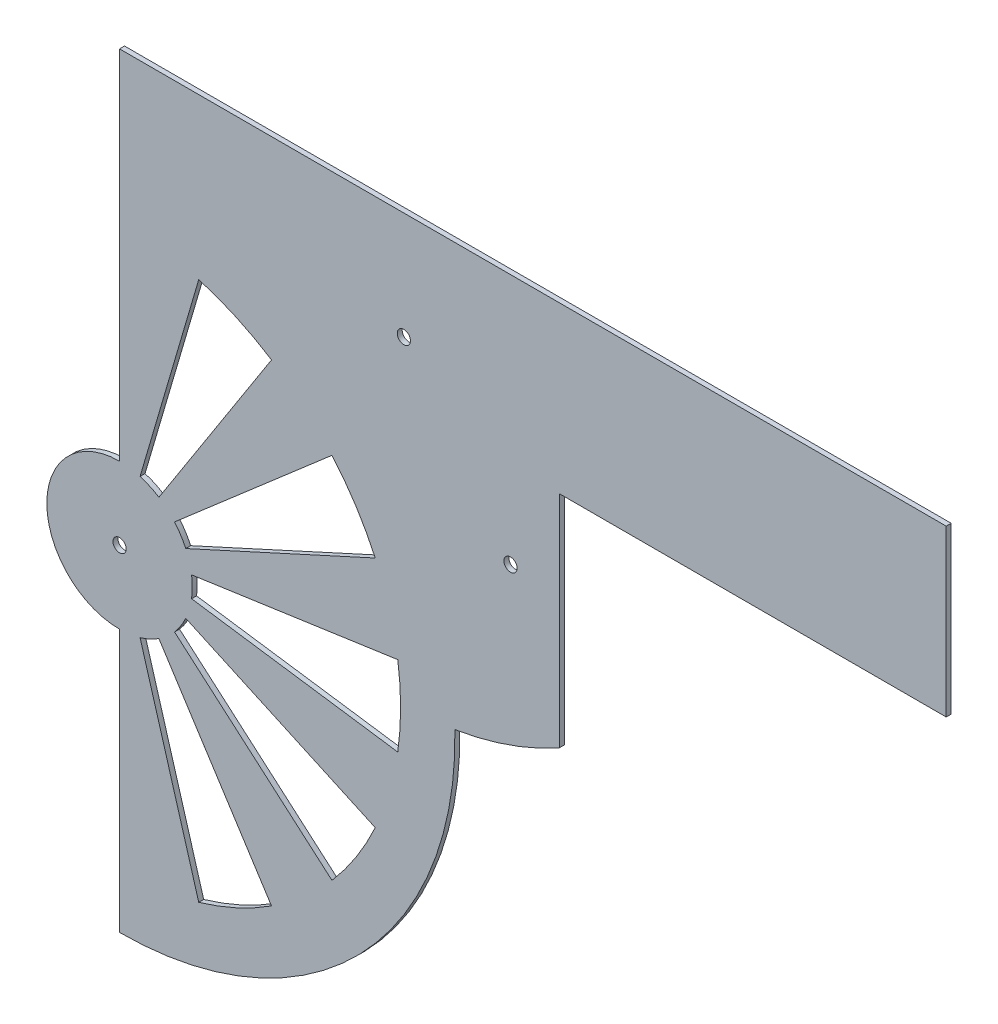
ISO-10303-21;
HEADER;
FILE_DESCRIPTION(('STEP AP214'),'2;1');
FILE_NAME('part.step','',(''),(''),'','','');
FILE_SCHEMA(('AUTOMOTIVE_DESIGN { 1 0 10303 214 1 1 1 1 }'));
ENDSEC;
DATA;
#1=APPLICATION_CONTEXT('core data for automotive mechanical design processes');
#2=APPLICATION_PROTOCOL_DEFINITION('international standard','automotive_design',2000,#1);
#3=PRODUCT_CONTEXT('',#1,'mechanical');
#4=PRODUCT('Part','Part','',(#3));
#5=PRODUCT_RELATED_PRODUCT_CATEGORY('part','',(#4));
#6=PRODUCT_DEFINITION_FORMATION('','',#4);
#7=PRODUCT_DEFINITION_CONTEXT('part definition',#1,'design');
#8=PRODUCT_DEFINITION('design','',#6,#7);
#9=PRODUCT_DEFINITION_SHAPE('','',#8);
#10=(LENGTH_UNIT() NAMED_UNIT(*) SI_UNIT(.MILLI.,.METRE.));
#11=(NAMED_UNIT(*) PLANE_ANGLE_UNIT() SI_UNIT($,.RADIAN.));
#12=(NAMED_UNIT(*) SI_UNIT($,.STERADIAN.) SOLID_ANGLE_UNIT());
#13=UNCERTAINTY_MEASURE_WITH_UNIT(LENGTH_MEASURE(1.E-05),#10,'distance_accuracy_value','');
#14=(GEOMETRIC_REPRESENTATION_CONTEXT(3) GLOBAL_UNCERTAINTY_ASSIGNED_CONTEXT((#13)) GLOBAL_UNIT_ASSIGNED_CONTEXT((#10,
#11,#12)) REPRESENTATION_CONTEXT('',''));
#15=CARTESIAN_POINT('',(0.,0.,0.));
#16=DIRECTION('',(0.,0.,1.));
#17=DIRECTION('',(1.,0.,0.));
#18=AXIS2_PLACEMENT_3D('',#15,#16,#17);
#19=CARTESIAN_POINT('',(85.9770201636294,97.5087278338861,1.5));
#20=DIRECTION('',(0.,0.,1.));
#21=DIRECTION('',(1.,0.,0.));
#22=AXIS2_PLACEMENT_3D('',#19,#20,#21);
#23=PLANE('',#22);
#24=CARTESIAN_POINT('',(0.,0.,1.5));
#25=DIRECTION('',(0.,0.,-1.));
#26=DIRECTION('',(1.,0.,0.));
#27=AXIS2_PLACEMENT_3D('',#24,#25,#26);
#28=CIRCLE('',#27,22.);
#29=CARTESIAN_POINT('',(21.7760717213805,3.13092644201265,1.5));
#30=VERTEX_POINT('',#29);
#31=CARTESIAN_POINT('',(21.7760717213806,-3.13092644201181,1.5));
#32=VERTEX_POINT('',#31);
#33=EDGE_CURVE('E48',#30,#32,#28,.T.);
#34=ORIENTED_EDGE('',*,*,#33,.F.);
#35=DIRECTION('',(-0.98982144188093,-0.142314838273304,0.));
#36=VECTOR('',#35,1.);
#37=CARTESIAN_POINT('',(21.7760717213805,3.13092644201265,1.5));
#38=LINE('',#37,#36);
#39=CARTESIAN_POINT('',(84.1348225598791,12.0967612532308,1.5));
#40=VERTEX_POINT('',#39);
#41=EDGE_CURVE('E242',#40,#30,#38,.T.);
#42=ORIENTED_EDGE('',*,*,#41,.F.);
#43=CARTESIAN_POINT('',(0.,0.,1.5));
#44=DIRECTION('',(0.,0.,1.));
#45=DIRECTION('',(1.,0.,0.));
#46=AXIS2_PLACEMENT_3D('',#43,#44,#45);
#47=CIRCLE('',#46,85.);
#48=CARTESIAN_POINT('',(84.1348225598796,-12.0967612532274,1.5));
#49=VERTEX_POINT('',#48);
#50=EDGE_CURVE('E245',#49,#40,#47,.T.);
#51=ORIENTED_EDGE('',*,*,#50,.F.);
#52=DIRECTION('',(0.989821441880936,-0.142314838273262,0.));
#53=VECTOR('',#52,1.);
#54=CARTESIAN_POINT('',(21.7760717213806,-3.13092644201181,1.5));
#55=LINE('',#54,#53);
#56=EDGE_CURVE('E251',#32,#49,#55,.T.);
#57=ORIENTED_EDGE('',*,*,#56,.F.);
#58=EDGE_LOOP('',(#34,#42,#51,#57));
#59=FACE_BOUND('',#58,.T.);
#60=CARTESIAN_POINT('',(0.,0.,1.5));
#61=DIRECTION('',(0.,0.,1.));
#62=DIRECTION('',(1.,0.,0.));
#63=AXIS2_PLACEMENT_3D('',#60,#61,#62);
#64=CIRCLE('',#63,85.);
#65=CARTESIAN_POINT('',(64.2387138201136,-55.6631623853473,1.5));
#66=VERTEX_POINT('',#65);
#67=CARTESIAN_POINT('',(77.318719605135,-35.3102761051583,1.5));
#68=VERTEX_POINT('',#67);
#69=EDGE_CURVE('E257',#66,#68,#64,.T.);
#70=ORIENTED_EDGE('',*,*,#69,.F.);
#71=DIRECTION('',(0.755749574354278,-0.654860733945262,0.));
#72=VECTOR('',#71,1.);
#73=CARTESIAN_POINT('',(16.6264906357941,-14.4069361467958,1.5));
#74=LINE('',#73,#72);
#75=CARTESIAN_POINT('',(16.6264906357941,-14.4069361467958,1.5));
#76=VERTEX_POINT('',#75);
#77=EDGE_CURVE('E265',#76,#66,#74,.T.);
#78=ORIENTED_EDGE('',*,*,#77,.F.);
#79=CARTESIAN_POINT('',(0.,0.,1.5));
#80=DIRECTION('',(0.,0.,-1.));
#81=DIRECTION('',(1.,0.,0.));
#82=AXIS2_PLACEMENT_3D('',#79,#80,#81);
#83=CIRCLE('',#82,22.);
#84=CARTESIAN_POINT('',(20.0119038977996,-9.139130286041,1.5));
#85=VERTEX_POINT('',#84);
#86=EDGE_CURVE('E279',#85,#76,#83,.T.);
#87=ORIENTED_EDGE('',*,*,#86,.F.);
#88=DIRECTION('',(-0.90963199535453,0.415415013001862,0.));
#89=VECTOR('',#88,1.);
#90=CARTESIAN_POINT('',(20.0119038977996,-9.139130286041,1.5));
#91=LINE('',#90,#89);
#92=EDGE_CURVE('E276',#68,#85,#91,.T.);
#93=ORIENTED_EDGE('',*,*,#92,.F.);
#94=EDGE_LOOP('',(#70,#78,#87,#93));
#95=FACE_BOUND('',#94,.T.);
#96=CARTESIAN_POINT('',(0.,0.,1.5));
#97=DIRECTION('',(0.,0.,-1.));
#98=DIRECTION('',(1.,0.,0.));
#99=AXIS2_PLACEMENT_3D('',#96,#97,#98);
#100=CIRCLE('',#99,22.);
#101=CARTESIAN_POINT('',(16.6264906357935,14.4069361467964,1.5));
#102=VERTEX_POINT('',#101);
#103=CARTESIAN_POINT('',(20.0119038977993,9.13913028604177,1.5));
#104=VERTEX_POINT('',#103);
#105=EDGE_CURVE('E286',#102,#104,#100,.T.);
#106=ORIENTED_EDGE('',*,*,#105,.F.);
#107=DIRECTION('',(-0.755749574354251,-0.654860733945294,0.));
#108=VECTOR('',#107,1.);
#109=CARTESIAN_POINT('',(16.6264906357935,14.4069361467964,1.5));
#110=LINE('',#109,#108);
#111=CARTESIAN_POINT('',(64.2387138201113,55.66316238535,1.5));
#112=VERTEX_POINT('',#111);
#113=EDGE_CURVE('E297',#112,#102,#110,.T.);
#114=ORIENTED_EDGE('',*,*,#113,.F.);
#115=CARTESIAN_POINT('',(0.,0.,1.5));
#116=DIRECTION('',(0.,0.,1.));
#117=DIRECTION('',(1.,0.,0.));
#118=AXIS2_PLACEMENT_3D('',#115,#116,#117);
#119=CIRCLE('',#118,85.);
#120=CARTESIAN_POINT('',(77.3187196051335,35.3102761051615,1.5));
#121=VERTEX_POINT('',#120);
#122=EDGE_CURVE('E311',#121,#112,#119,.T.);
#123=ORIENTED_EDGE('',*,*,#122,.F.);
#124=DIRECTION('',(0.909631995354512,0.415415013001901,0.));
#125=VECTOR('',#124,1.);
#126=CARTESIAN_POINT('',(20.0119038977993,9.13913028604177,1.5));
#127=LINE('',#126,#125);
#128=EDGE_CURVE('E308',#104,#121,#127,.T.);
#129=ORIENTED_EDGE('',*,*,#128,.F.);
#130=EDGE_LOOP('',(#106,#114,#123,#129));
#131=FACE_BOUND('',#130,.T.);
#132=CARTESIAN_POINT('',(0.,0.,1.5));
#133=DIRECTION('',(0.,0.,1.));
#134=DIRECTION('',(1.,0.,0.));
#135=AXIS2_PLACEMENT_3D('',#132,#133,#134);
#136=CIRCLE('',#135,85.);
#137=CARTESIAN_POINT('',(23.9472673315246,-81.5569027572314,1.5));
#138=VERTEX_POINT('',#137);
#139=CARTESIAN_POINT('',(45.9544694837282,-71.5065502906489,1.5));
#140=VERTEX_POINT('',#139);
#141=EDGE_CURVE('E318',#138,#140,#136,.T.);
#142=ORIENTED_EDGE('',*,*,#141,.F.);
#143=DIRECTION('',(0.281732556841467,-0.959492973614486,0.));
#144=VECTOR('',#143,1.);
#145=CARTESIAN_POINT('',(6.19811625051222,-21.1088454195187,1.5));
#146=LINE('',#145,#144);
#147=CARTESIAN_POINT('',(6.19811625051222,-21.1088454195187,1.5));
#148=VERTEX_POINT('',#147);
#149=EDGE_CURVE('E329',#148,#138,#146,.T.);
#150=ORIENTED_EDGE('',*,*,#149,.F.);
#151=CARTESIAN_POINT('',(0.,0.,1.5));
#152=DIRECTION('',(0.,0.,-1.));
#153=DIRECTION('',(1.,0.,0.));
#154=AXIS2_PLACEMENT_3D('',#151,#152,#153);
#155=CIRCLE('',#154,22.);
#156=CARTESIAN_POINT('',(11.8940979840237,-18.5075777222856,1.5));
#157=VERTEX_POINT('',#156);
#158=EDGE_CURVE('E343',#157,#148,#155,.T.);
#159=ORIENTED_EDGE('',*,*,#158,.F.);
#160=DIRECTION('',(-0.540640817455627,0.841253532831163,0.));
#161=VECTOR('',#160,1.);
#162=CARTESIAN_POINT('',(11.8940979840237,-18.5075777222856,1.5));
#163=LINE('',#162,#161);
#164=EDGE_CURVE('E340',#140,#157,#163,.T.);
#165=ORIENTED_EDGE('',*,*,#164,.F.);
#166=EDGE_LOOP('',(#142,#150,#159,#165));
#167=FACE_BOUND('',#166,.T.);
#168=CARTESIAN_POINT('',(0.,0.,1.5));
#169=DIRECTION('',(0.,0.,-1.));
#170=DIRECTION('',(1.,0.,0.));
#171=AXIS2_PLACEMENT_3D('',#168,#169,#170);
#172=CIRCLE('',#171,22.);
#173=CARTESIAN_POINT('',(6.19811625051141,21.108845419519,1.5));
#174=VERTEX_POINT('',#173);
#175=CARTESIAN_POINT('',(11.894097984023,18.5075777222861,1.5));
#176=VERTEX_POINT('',#175);
#177=EDGE_CURVE('E350',#174,#176,#172,.T.);
#178=ORIENTED_EDGE('',*,*,#177,.F.);
#179=DIRECTION('',(-0.281732556841426,-0.959492973614498,0.));
#180=VECTOR('',#179,1.);
#181=CARTESIAN_POINT('',(6.19811625051141,21.108845419519,1.5));
#182=LINE('',#181,#180);
#183=CARTESIAN_POINT('',(23.9472673315213,81.5569027572324,1.5));
#184=VERTEX_POINT('',#183);
#185=EDGE_CURVE('E361',#184,#174,#182,.T.);
#186=ORIENTED_EDGE('',*,*,#185,.F.);
#187=CARTESIAN_POINT('',(0.,0.,1.5));
#188=DIRECTION('',(0.,0.,1.));
#189=DIRECTION('',(1.,0.,0.));
#190=AXIS2_PLACEMENT_3D('',#187,#188,#189);
#191=CIRCLE('',#190,85.);
#192=CARTESIAN_POINT('',(45.9544694837253,71.5065502906507,1.5));
#193=VERTEX_POINT('',#192);
#194=EDGE_CURVE('E375',#193,#184,#191,.T.);
#195=ORIENTED_EDGE('',*,*,#194,.F.);
#196=DIRECTION('',(0.540640817455591,0.841253532831185,0.));
#197=VECTOR('',#196,1.);
#198=CARTESIAN_POINT('',(11.894097984023,18.5075777222861,1.5));
#199=LINE('',#198,#197);
#200=EDGE_CURVE('E372',#176,#193,#199,.T.);
#201=ORIENTED_EDGE('',*,*,#200,.F.);
#202=EDGE_LOOP('',(#178,#186,#195,#201));
#203=FACE_BOUND('',#202,.T.);
#204=CARTESIAN_POINT('',(85.9770201636294,97.5087278338861,1.5));
#205=DIRECTION('',(0.,0.,1.));
#206=DIRECTION('',(1.,0.,0.));
#207=AXIS2_PLACEMENT_3D('',#204,#205,#206);
#208=CIRCLE('',#207,2.);
#209=CARTESIAN_POINT('',(87.9770201636294,97.5087278338861,1.5));
#210=VERTEX_POINT('',#209);
#211=EDGE_CURVE('E395',#210,#210,#208,.T.);
#212=ORIENTED_EDGE('',*,*,#211,.F.);
#213=EDGE_LOOP('',(#212));
#214=FACE_BOUND('',#213,.T.);
#215=DIRECTION('',(-1.,0.,0.));
#216=VECTOR('',#215,1.);
#217=CARTESIAN_POINT('',(0.,130.,1.5));
#218=LINE('',#217,#216);
#219=CARTESIAN_POINT('',(250.,130.,1.5));
#220=VERTEX_POINT('',#219);
#221=CARTESIAN_POINT('',(0.,130.,1.5));
#222=VERTEX_POINT('',#221);
#223=EDGE_CURVE('E407',#220,#222,#218,.T.);
#224=ORIENTED_EDGE('',*,*,#223,.T.);
#225=DIRECTION('',(0.,-1.,0.));
#226=VECTOR('',#225,1.);
#227=CARTESIAN_POINT('',(0.,130.,1.5));
#228=LINE('',#227,#226);
#229=CARTESIAN_POINT('',(0.,22.,1.5));
#230=VERTEX_POINT('',#229);
#231=EDGE_CURVE('E410',#222,#230,#228,.T.);
#232=ORIENTED_EDGE('',*,*,#231,.T.);
#233=CARTESIAN_POINT('',(0.,0.,1.5));
#234=DIRECTION('',(0.,0.,1.));
#235=DIRECTION('',(1.,0.,0.));
#236=AXIS2_PLACEMENT_3D('',#233,#234,#235);
#237=CIRCLE('',#236,22.);
#238=CARTESIAN_POINT('',(0.,-22.,1.5));
#239=VERTEX_POINT('',#238);
#240=EDGE_CURVE('E413',#230,#239,#237,.T.);
#241=ORIENTED_EDGE('',*,*,#240,.T.);
#242=DIRECTION('',(0.,-1.,0.));
#243=VECTOR('',#242,1.);
#244=CARTESIAN_POINT('',(0.,-22.,1.5));
#245=LINE('',#244,#243);
#246=CARTESIAN_POINT('',(0.,-101.42617394616,1.5));
#247=VERTEX_POINT('',#246);
#248=EDGE_CURVE('E415',#239,#247,#245,.T.);
#249=ORIENTED_EDGE('',*,*,#248,.T.);
#250=CARTESIAN_POINT('',(0.,0.,1.5));
#251=DIRECTION('',(0.,0.,1.));
#252=DIRECTION('',(1.,0.,0.));
#253=AXIS2_PLACEMENT_3D('',#250,#251,#252);
#254=CIRCLE('',#253,101.42617394616);
#255=CARTESIAN_POINT('',(101.397454871573,2.41348439478572,1.5));
#256=VERTEX_POINT('',#255);
#257=EDGE_CURVE('E417',#247,#256,#254,.T.);
#258=ORIENTED_EDGE('',*,*,#257,.T.);
#259=CARTESIAN_POINT('',(85.9770201636294,97.5087278338861,1.5));
#260=DIRECTION('',(0.,0.,1.));
#261=DIRECTION('',(1.,0.,0.));
#262=AXIS2_PLACEMENT_3D('',#259,#260,#261);
#263=CIRCLE('',#262,96.3374025564512);
#264=CARTESIAN_POINT('',(132.983960447751,13.4180464449907,1.5));
#265=VERTEX_POINT('',#264);
#266=EDGE_CURVE('E419',#256,#265,#263,.T.);
#267=ORIENTED_EDGE('',*,*,#266,.T.);
#268=DIRECTION('',(0.,1.,0.));
#269=VECTOR('',#268,1.);
#270=CARTESIAN_POINT('',(132.983960447751,80.,1.5));
#271=LINE('',#270,#269);
#272=CARTESIAN_POINT('',(132.983960447751,80.,1.5));
#273=VERTEX_POINT('',#272);
#274=EDGE_CURVE('E421',#265,#273,#271,.T.);
#275=ORIENTED_EDGE('',*,*,#274,.T.);
#276=DIRECTION('',(1.,0.,0.));
#277=VECTOR('',#276,1.);
#278=CARTESIAN_POINT('',(250.,80.,1.5));
#279=LINE('',#278,#277);
#280=CARTESIAN_POINT('',(250.,80.,1.5));
#281=VERTEX_POINT('',#280);
#282=EDGE_CURVE('E423',#273,#281,#279,.T.);
#283=ORIENTED_EDGE('',*,*,#282,.T.);
#284=DIRECTION('',(0.,1.,0.));
#285=VECTOR('',#284,1.);
#286=CARTESIAN_POINT('',(250.,130.,1.5));
#287=LINE('',#286,#285);
#288=EDGE_CURVE('E425',#281,#220,#287,.T.);
#289=ORIENTED_EDGE('',*,*,#288,.T.);
#290=EDGE_LOOP('',(#224,#232,#241,#249,#258,#267,#275,#283,#289));
#291=FACE_BOUND('',#290,.T.);
#292=CARTESIAN_POINT('',(0.,0.,1.5));
#293=DIRECTION('',(0.,0.,1.));
#294=DIRECTION('',(1.,0.,0.));
#295=AXIS2_PLACEMENT_3D('',#292,#293,#294);
#296=CIRCLE('',#295,2.);
#297=CARTESIAN_POINT('',(2.,0.,1.5));
#298=VERTEX_POINT('',#297);
#299=EDGE_CURVE('E401',#298,#298,#296,.T.);
#300=ORIENTED_EDGE('',*,*,#299,.F.);
#301=EDGE_LOOP('',(#300));
#302=FACE_BOUND('',#301,.T.);
#303=CARTESIAN_POINT('',(118.232097826927,54.0478588238605,1.5));
#304=DIRECTION('',(0.,0.,1.));
#305=DIRECTION('',(1.,0.,0.));
#306=AXIS2_PLACEMENT_3D('',#303,#304,#305);
#307=CIRCLE('',#306,2.);
#308=CARTESIAN_POINT('',(120.232097826927,54.0478588238605,1.5));
#309=VERTEX_POINT('',#308);
#310=EDGE_CURVE('E389',#309,#309,#307,.T.);
#311=ORIENTED_EDGE('',*,*,#310,.F.);
#312=EDGE_LOOP('',(#311));
#313=FACE_BOUND('',#312,.T.);
#314=ADVANCED_FACE('F33',(#59,#95,#131,#167,#203,#214,#291,#302,#313),#23,.T.);
#315=CARTESIAN_POINT('',(85.9770201636294,97.5087278338861,0.));
#316=DIRECTION('',(0.,0.,1.));
#317=DIRECTION('',(1.,0.,0.));
#318=AXIS2_PLACEMENT_3D('',#315,#316,#317);
#319=PLANE('',#318);
#320=DIRECTION('',(-0.98982144188093,-0.142314838273304,0.));
#321=VECTOR('',#320,1.);
#322=CARTESIAN_POINT('',(21.7760717213805,3.13092644201265,0.));
#323=LINE('',#322,#321);
#324=CARTESIAN_POINT('',(84.1348225598791,12.0967612532308,0.));
#325=VERTEX_POINT('',#324);
#326=CARTESIAN_POINT('',(21.7760717213805,3.13092644201265,0.));
#327=VERTEX_POINT('',#326);
#328=EDGE_CURVE('E232',#325,#327,#323,.T.);
#329=ORIENTED_EDGE('',*,*,#328,.T.);
#330=CARTESIAN_POINT('',(0.,0.,0.));
#331=DIRECTION('',(0.,0.,-1.));
#332=DIRECTION('',(1.,0.,0.));
#333=AXIS2_PLACEMENT_3D('',#330,#331,#332);
#334=CIRCLE('',#333,22.);
#335=CARTESIAN_POINT('',(21.7760717213806,-3.13092644201181,0.));
#336=VERTEX_POINT('',#335);
#337=EDGE_CURVE('E226',#327,#336,#334,.T.);
#338=ORIENTED_EDGE('',*,*,#337,.T.);
#339=DIRECTION('',(0.989821441880936,-0.142314838273262,0.));
#340=VECTOR('',#339,1.);
#341=CARTESIAN_POINT('',(21.7760717213806,-3.13092644201181,0.));
#342=LINE('',#341,#340);
#343=CARTESIAN_POINT('',(84.1348225598796,-12.0967612532273,0.));
#344=VERTEX_POINT('',#343);
#345=EDGE_CURVE('E235',#336,#344,#342,.T.);
#346=ORIENTED_EDGE('',*,*,#345,.T.);
#347=CARTESIAN_POINT('',(0.,0.,0.));
#348=DIRECTION('',(0.,0.,1.));
#349=DIRECTION('',(1.,0.,0.));
#350=AXIS2_PLACEMENT_3D('',#347,#348,#349);
#351=CIRCLE('',#350,85.);
#352=EDGE_CURVE('E56',#344,#325,#351,.T.);
#353=ORIENTED_EDGE('',*,*,#352,.T.);
#354=EDGE_LOOP('',(#329,#338,#346,#353));
#355=FACE_BOUND('',#354,.T.);
#356=DIRECTION('',(0.755749574354278,-0.654860733945262,0.));
#357=VECTOR('',#356,1.);
#358=CARTESIAN_POINT('',(16.6264906357941,-14.4069361467958,0.));
#359=LINE('',#358,#357);
#360=CARTESIAN_POINT('',(16.6264906357941,-14.4069361467958,0.));
#361=VERTEX_POINT('',#360);
#362=CARTESIAN_POINT('',(64.2387138201136,-55.6631623853473,0.));
#363=VERTEX_POINT('',#362);
#364=EDGE_CURVE('E271',#361,#363,#359,.T.);
#365=ORIENTED_EDGE('',*,*,#364,.T.);
#366=CARTESIAN_POINT('',(0.,0.,0.));
#367=DIRECTION('',(0.,0.,1.));
#368=DIRECTION('',(1.,0.,0.));
#369=AXIS2_PLACEMENT_3D('',#366,#367,#368);
#370=CIRCLE('',#369,85.);
#371=CARTESIAN_POINT('',(77.318719605135,-35.3102761051583,0.));
#372=VERTEX_POINT('',#371);
#373=EDGE_CURVE('E261',#363,#372,#370,.T.);
#374=ORIENTED_EDGE('',*,*,#373,.T.);
#375=DIRECTION('',(-0.90963199535453,0.415415013001862,0.));
#376=VECTOR('',#375,1.);
#377=CARTESIAN_POINT('',(20.0119038977996,-9.139130286041,0.));
#378=LINE('',#377,#376);
#379=CARTESIAN_POINT('',(20.0119038977996,-9.13913028604101,0.));
#380=VERTEX_POINT('',#379);
#381=EDGE_CURVE('E264',#372,#380,#378,.T.);
#382=ORIENTED_EDGE('',*,*,#381,.T.);
#383=CARTESIAN_POINT('',(0.,0.,0.));
#384=DIRECTION('',(0.,0.,-1.));
#385=DIRECTION('',(1.,0.,0.));
#386=AXIS2_PLACEMENT_3D('',#383,#384,#385);
#387=CIRCLE('',#386,22.);
#388=EDGE_CURVE('E268',#380,#361,#387,.T.);
#389=ORIENTED_EDGE('',*,*,#388,.T.);
#390=EDGE_LOOP('',(#365,#374,#382,#389));
#391=FACE_BOUND('',#390,.T.);
#392=DIRECTION('',(-0.755749574354251,-0.654860733945294,0.));
#393=VECTOR('',#392,1.);
#394=CARTESIAN_POINT('',(16.6264906357935,14.4069361467964,0.));
#395=LINE('',#394,#393);
#396=CARTESIAN_POINT('',(64.2387138201113,55.66316238535,0.));
#397=VERTEX_POINT('',#396);
#398=CARTESIAN_POINT('',(16.6264906357935,14.4069361467964,0.));
#399=VERTEX_POINT('',#398);
#400=EDGE_CURVE('E303',#397,#399,#395,.T.);
#401=ORIENTED_EDGE('',*,*,#400,.T.);
#402=CARTESIAN_POINT('',(0.,0.,0.));
#403=DIRECTION('',(0.,0.,-1.));
#404=DIRECTION('',(1.,0.,0.));
#405=AXIS2_PLACEMENT_3D('',#402,#403,#404);
#406=CIRCLE('',#405,22.);
#407=CARTESIAN_POINT('',(20.0119038977993,9.13913028604177,0.));
#408=VERTEX_POINT('',#407);
#409=EDGE_CURVE('E293',#399,#408,#406,.T.);
#410=ORIENTED_EDGE('',*,*,#409,.T.);
#411=DIRECTION('',(0.909631995354512,0.415415013001901,0.));
#412=VECTOR('',#411,1.);
#413=CARTESIAN_POINT('',(20.0119038977993,9.13913028604177,0.));
#414=LINE('',#413,#412);
#415=CARTESIAN_POINT('',(77.3187196051335,35.3102761051615,0.));
#416=VERTEX_POINT('',#415);
#417=EDGE_CURVE('E296',#408,#416,#414,.T.);
#418=ORIENTED_EDGE('',*,*,#417,.T.);
#419=CARTESIAN_POINT('',(0.,0.,0.));
#420=DIRECTION('',(0.,0.,1.));
#421=DIRECTION('',(1.,0.,0.));
#422=AXIS2_PLACEMENT_3D('',#419,#420,#421);
#423=CIRCLE('',#422,85.);
#424=EDGE_CURVE('E300',#416,#397,#423,.T.);
#425=ORIENTED_EDGE('',*,*,#424,.T.);
#426=EDGE_LOOP('',(#401,#410,#418,#425));
#427=FACE_BOUND('',#426,.T.);
#428=DIRECTION('',(0.281732556841467,-0.959492973614486,0.));
#429=VECTOR('',#428,1.);
#430=CARTESIAN_POINT('',(6.19811625051222,-21.1088454195187,0.));
#431=LINE('',#430,#429);
#432=CARTESIAN_POINT('',(6.19811625051222,-21.1088454195187,0.));
#433=VERTEX_POINT('',#432);
#434=CARTESIAN_POINT('',(23.9472673315246,-81.5569027572314,0.));
#435=VERTEX_POINT('',#434);
#436=EDGE_CURVE('E335',#433,#435,#431,.T.);
#437=ORIENTED_EDGE('',*,*,#436,.T.);
#438=CARTESIAN_POINT('',(0.,0.,0.));
#439=DIRECTION('',(0.,0.,1.));
#440=DIRECTION('',(1.,0.,0.));
#441=AXIS2_PLACEMENT_3D('',#438,#439,#440);
#442=CIRCLE('',#441,85.);
#443=CARTESIAN_POINT('',(45.9544694837282,-71.5065502906489,0.));
#444=VERTEX_POINT('',#443);
#445=EDGE_CURVE('E325',#435,#444,#442,.T.);
#446=ORIENTED_EDGE('',*,*,#445,.T.);
#447=DIRECTION('',(-0.540640817455627,0.841253532831163,0.));
#448=VECTOR('',#447,1.);
#449=CARTESIAN_POINT('',(11.8940979840237,-18.5075777222856,0.));
#450=LINE('',#449,#448);
#451=CARTESIAN_POINT('',(11.8940979840237,-18.5075777222856,0.));
#452=VERTEX_POINT('',#451);
#453=EDGE_CURVE('E328',#444,#452,#450,.T.);
#454=ORIENTED_EDGE('',*,*,#453,.T.);
#455=CARTESIAN_POINT('',(0.,0.,0.));
#456=DIRECTION('',(0.,0.,-1.));
#457=DIRECTION('',(1.,0.,0.));
#458=AXIS2_PLACEMENT_3D('',#455,#456,#457);
#459=CIRCLE('',#458,22.);
#460=EDGE_CURVE('E332',#452,#433,#459,.T.);
#461=ORIENTED_EDGE('',*,*,#460,.T.);
#462=EDGE_LOOP('',(#437,#446,#454,#461));
#463=FACE_BOUND('',#462,.T.);
#464=DIRECTION('',(-0.281732556841426,-0.959492973614498,0.));
#465=VECTOR('',#464,1.);
#466=CARTESIAN_POINT('',(6.19811625051141,21.108845419519,0.));
#467=LINE('',#466,#465);
#468=CARTESIAN_POINT('',(23.9472673315213,81.5569027572324,0.));
#469=VERTEX_POINT('',#468);
#470=CARTESIAN_POINT('',(6.19811625051141,21.108845419519,0.));
#471=VERTEX_POINT('',#470);
#472=EDGE_CURVE('E367',#469,#471,#467,.T.);
#473=ORIENTED_EDGE('',*,*,#472,.T.);
#474=CARTESIAN_POINT('',(0.,0.,0.));
#475=DIRECTION('',(0.,0.,-1.));
#476=DIRECTION('',(1.,0.,0.));
#477=AXIS2_PLACEMENT_3D('',#474,#475,#476);
#478=CIRCLE('',#477,22.);
#479=CARTESIAN_POINT('',(11.894097984023,18.5075777222861,0.));
#480=VERTEX_POINT('',#479);
#481=EDGE_CURVE('E357',#471,#480,#478,.T.);
#482=ORIENTED_EDGE('',*,*,#481,.T.);
#483=DIRECTION('',(0.540640817455591,0.841253532831185,0.));
#484=VECTOR('',#483,1.);
#485=CARTESIAN_POINT('',(11.894097984023,18.5075777222861,0.));
#486=LINE('',#485,#484);
#487=CARTESIAN_POINT('',(45.9544694837253,71.5065502906507,0.));
#488=VERTEX_POINT('',#487);
#489=EDGE_CURVE('E360',#480,#488,#486,.T.);
#490=ORIENTED_EDGE('',*,*,#489,.T.);
#491=CARTESIAN_POINT('',(0.,0.,0.));
#492=DIRECTION('',(0.,0.,1.));
#493=DIRECTION('',(1.,0.,0.));
#494=AXIS2_PLACEMENT_3D('',#491,#492,#493);
#495=CIRCLE('',#494,85.);
#496=EDGE_CURVE('E364',#488,#469,#495,.T.);
#497=ORIENTED_EDGE('',*,*,#496,.T.);
#498=EDGE_LOOP('',(#473,#482,#490,#497));
#499=FACE_BOUND('',#498,.T.);
#500=CARTESIAN_POINT('',(85.9770201636294,97.5087278338861,0.));
#501=DIRECTION('',(0.,0.,1.));
#502=DIRECTION('',(1.,0.,0.));
#503=AXIS2_PLACEMENT_3D('',#500,#501,#502);
#504=CIRCLE('',#503,2.);
#505=CARTESIAN_POINT('',(87.9770201636294,97.5087278338861,0.));
#506=VERTEX_POINT('',#505);
#507=EDGE_CURVE('E392',#506,#506,#504,.T.);
#508=ORIENTED_EDGE('',*,*,#507,.T.);
#509=EDGE_LOOP('',(#508));
#510=FACE_BOUND('',#509,.T.);
#511=DIRECTION('',(-1.,0.,0.));
#512=VECTOR('',#511,1.);
#513=CARTESIAN_POINT('',(0.,130.,0.));
#514=LINE('',#513,#512);
#515=CARTESIAN_POINT('',(250.,130.,0.));
#516=VERTEX_POINT('',#515);
#517=CARTESIAN_POINT('',(0.,130.,0.));
#518=VERTEX_POINT('',#517);
#519=EDGE_CURVE('E404',#516,#518,#514,.T.);
#520=ORIENTED_EDGE('',*,*,#519,.F.);
#521=DIRECTION('',(0.,1.,0.));
#522=VECTOR('',#521,1.);
#523=CARTESIAN_POINT('',(250.,130.,0.));
#524=LINE('',#523,#522);
#525=CARTESIAN_POINT('',(250.,80.,0.));
#526=VERTEX_POINT('',#525);
#527=EDGE_CURVE('E411',#526,#516,#524,.T.);
#528=ORIENTED_EDGE('',*,*,#527,.F.);
#529=DIRECTION('',(1.,0.,0.));
#530=VECTOR('',#529,1.);
#531=CARTESIAN_POINT('',(250.,80.,0.));
#532=LINE('',#531,#530);
#533=CARTESIAN_POINT('',(132.983960447751,80.,0.));
#534=VERTEX_POINT('',#533);
#535=EDGE_CURVE('E442',#534,#526,#532,.T.);
#536=ORIENTED_EDGE('',*,*,#535,.F.);
#537=DIRECTION('',(0.,1.,0.));
#538=VECTOR('',#537,1.);
#539=CARTESIAN_POINT('',(132.983960447751,80.,0.));
#540=LINE('',#539,#538);
#541=CARTESIAN_POINT('',(132.983960447751,13.4180464449907,0.));
#542=VERTEX_POINT('',#541);
#543=EDGE_CURVE('E440',#542,#534,#540,.T.);
#544=ORIENTED_EDGE('',*,*,#543,.F.);
#545=CARTESIAN_POINT('',(85.9770201636294,97.5087278338861,0.));
#546=DIRECTION('',(0.,0.,1.));
#547=DIRECTION('',(1.,0.,0.));
#548=AXIS2_PLACEMENT_3D('',#545,#546,#547);
#549=CIRCLE('',#548,96.3374025564512);
#550=CARTESIAN_POINT('',(101.397454871573,2.41348439478572,0.));
#551=VERTEX_POINT('',#550);
#552=EDGE_CURVE('E438',#551,#542,#549,.T.);
#553=ORIENTED_EDGE('',*,*,#552,.F.);
#554=CARTESIAN_POINT('',(0.,0.,0.));
#555=DIRECTION('',(0.,0.,1.));
#556=DIRECTION('',(1.,0.,0.));
#557=AXIS2_PLACEMENT_3D('',#554,#555,#556);
#558=CIRCLE('',#557,101.42617394616);
#559=CARTESIAN_POINT('',(0.,-101.42617394616,0.));
#560=VERTEX_POINT('',#559);
#561=EDGE_CURVE('E436',#560,#551,#558,.T.);
#562=ORIENTED_EDGE('',*,*,#561,.F.);
#563=DIRECTION('',(0.,-1.,0.));
#564=VECTOR('',#563,1.);
#565=CARTESIAN_POINT('',(0.,-22.,0.));
#566=LINE('',#565,#564);
#567=CARTESIAN_POINT('',(0.,-22.,0.));
#568=VERTEX_POINT('',#567);
#569=EDGE_CURVE('E434',#568,#560,#566,.T.);
#570=ORIENTED_EDGE('',*,*,#569,.F.);
#571=CARTESIAN_POINT('',(0.,0.,0.));
#572=DIRECTION('',(0.,0.,1.));
#573=DIRECTION('',(1.,0.,0.));
#574=AXIS2_PLACEMENT_3D('',#571,#572,#573);
#575=CIRCLE('',#574,22.);
#576=CARTESIAN_POINT('',(0.,22.,0.));
#577=VERTEX_POINT('',#576);
#578=EDGE_CURVE('E432',#577,#568,#575,.T.);
#579=ORIENTED_EDGE('',*,*,#578,.F.);
#580=DIRECTION('',(0.,-1.,0.));
#581=VECTOR('',#580,1.);
#582=CARTESIAN_POINT('',(0.,130.,0.));
#583=LINE('',#582,#581);
#584=EDGE_CURVE('E430',#518,#577,#583,.T.);
#585=ORIENTED_EDGE('',*,*,#584,.F.);
#586=EDGE_LOOP('',(#520,#528,#536,#544,#553,#562,#570,#579,#585));
#587=FACE_BOUND('',#586,.T.);
#588=CARTESIAN_POINT('',(0.,0.,0.));
#589=DIRECTION('',(0.,0.,1.));
#590=DIRECTION('',(1.,0.,0.));
#591=AXIS2_PLACEMENT_3D('',#588,#589,#590);
#592=CIRCLE('',#591,2.);
#593=CARTESIAN_POINT('',(2.,0.,0.));
#594=VERTEX_POINT('',#593);
#595=EDGE_CURVE('E398',#594,#594,#592,.T.);
#596=ORIENTED_EDGE('',*,*,#595,.T.);
#597=EDGE_LOOP('',(#596));
#598=FACE_BOUND('',#597,.T.);
#599=CARTESIAN_POINT('',(118.232097826927,54.0478588238605,0.));
#600=DIRECTION('',(0.,0.,1.));
#601=DIRECTION('',(1.,0.,0.));
#602=AXIS2_PLACEMENT_3D('',#599,#600,#601);
#603=CIRCLE('',#602,2.);
#604=CARTESIAN_POINT('',(120.232097826927,54.0478588238605,0.));
#605=VERTEX_POINT('',#604);
#606=EDGE_CURVE('E382',#605,#605,#603,.T.);
#607=ORIENTED_EDGE('',*,*,#606,.T.);
#608=EDGE_LOOP('',(#607));
#609=FACE_BOUND('',#608,.T.);
#610=ADVANCED_FACE('F239',(#355,#391,#427,#463,#499,#510,#587,#598,#609),#319,.F.);
#611=CARTESIAN_POINT('',(0.,130.,1.5));
#612=DIRECTION('',(0.,-1.,0.));
#613=DIRECTION('',(0.,0.,-1.));
#614=AXIS2_PLACEMENT_3D('',#611,#612,#613);
#615=PLANE('',#614);
#616=ORIENTED_EDGE('',*,*,#519,.T.);
#617=DIRECTION('',(0.,0.,-1.));
#618=VECTOR('',#617,1.);
#619=CARTESIAN_POINT('',(0.,130.,1.5));
#620=LINE('',#619,#618);
#621=EDGE_CURVE('E11',#222,#518,#620,.T.);
#622=ORIENTED_EDGE('',*,*,#621,.F.);
#623=ORIENTED_EDGE('',*,*,#223,.F.);
#624=DIRECTION('',(0.,0.,-1.));
#625=VECTOR('',#624,1.);
#626=CARTESIAN_POINT('',(250.,130.,1.5));
#627=LINE('',#626,#625);
#628=EDGE_CURVE('E427',#220,#516,#627,.T.);
#629=ORIENTED_EDGE('',*,*,#628,.T.);
#630=EDGE_LOOP('',(#616,#622,#623,#629));
#631=FACE_BOUND('',#630,.T.);
#632=ADVANCED_FACE('F35',(#631),#615,.F.);
#633=CARTESIAN_POINT('',(0.,130.,1.5));
#634=DIRECTION('',(1.,0.,0.));
#635=DIRECTION('',(0.,0.,-1.));
#636=AXIS2_PLACEMENT_3D('',#633,#634,#635);
#637=PLANE('',#636);
#638=ORIENTED_EDGE('',*,*,#584,.T.);
#639=DIRECTION('',(0.,0.,-1.));
#640=VECTOR('',#639,1.);
#641=CARTESIAN_POINT('',(0.,22.,1.5));
#642=LINE('',#641,#640);
#643=EDGE_CURVE('E41',#230,#577,#642,.T.);
#644=ORIENTED_EDGE('',*,*,#643,.F.);
#645=ORIENTED_EDGE('',*,*,#231,.F.);
#646=ORIENTED_EDGE('',*,*,#621,.T.);
#647=EDGE_LOOP('',(#638,#644,#645,#646));
#648=FACE_BOUND('',#647,.T.);
#649=ADVANCED_FACE('F492',(#648),#637,.F.);
#650=CARTESIAN_POINT('',(0.,0.,1.5));
#651=DIRECTION('',(0.,0.,-1.));
#652=DIRECTION('',(-1.,0.,0.));
#653=AXIS2_PLACEMENT_3D('',#650,#651,#652);
#654=CYLINDRICAL_SURFACE('',#653,22.);
#655=ORIENTED_EDGE('',*,*,#578,.T.);
#656=DIRECTION('',(0.,0.,-1.));
#657=VECTOR('',#656,1.);
#658=CARTESIAN_POINT('',(0.,-22.,1.5));
#659=LINE('',#658,#657);
#660=EDGE_CURVE('E462',#239,#568,#659,.T.);
#661=ORIENTED_EDGE('',*,*,#660,.F.);
#662=ORIENTED_EDGE('',*,*,#240,.F.);
#663=ORIENTED_EDGE('',*,*,#643,.T.);
#664=EDGE_LOOP('',(#655,#661,#662,#663));
#665=FACE_BOUND('',#664,.T.);
#666=ADVANCED_FACE('F469',(#665),#654,.T.);
#667=CARTESIAN_POINT('',(0.,-22.,1.5));
#668=DIRECTION('',(1.,0.,0.));
#669=DIRECTION('',(0.,0.,-1.));
#670=AXIS2_PLACEMENT_3D('',#667,#668,#669);
#671=PLANE('',#670);
#672=ORIENTED_EDGE('',*,*,#569,.T.);
#673=DIRECTION('',(0.,0.,-1.));
#674=VECTOR('',#673,1.);
#675=CARTESIAN_POINT('',(0.,-101.42617394616,1.5));
#676=LINE('',#675,#674);
#677=EDGE_CURVE('E459',#247,#560,#676,.T.);
#678=ORIENTED_EDGE('',*,*,#677,.F.);
#679=ORIENTED_EDGE('',*,*,#248,.F.);
#680=ORIENTED_EDGE('',*,*,#660,.T.);
#681=EDGE_LOOP('',(#672,#678,#679,#680));
#682=FACE_BOUND('',#681,.T.);
#683=ADVANCED_FACE('F480',(#682),#671,.F.);
#684=CARTESIAN_POINT('',(0.,0.,1.5));
#685=DIRECTION('',(0.,0.,-1.));
#686=DIRECTION('',(-1.,0.,0.));
#687=AXIS2_PLACEMENT_3D('',#684,#685,#686);
#688=CYLINDRICAL_SURFACE('',#687,101.42617394616);
#689=ORIENTED_EDGE('',*,*,#561,.T.);
#690=DIRECTION('',(0.,0.,-1.));
#691=VECTOR('',#690,1.);
#692=CARTESIAN_POINT('',(101.397454871573,2.41348439478572,1.5));
#693=LINE('',#692,#691);
#694=EDGE_CURVE('E456',#256,#551,#693,.T.);
#695=ORIENTED_EDGE('',*,*,#694,.F.);
#696=ORIENTED_EDGE('',*,*,#257,.F.);
#697=ORIENTED_EDGE('',*,*,#677,.T.);
#698=EDGE_LOOP('',(#689,#695,#696,#697));
#699=FACE_BOUND('',#698,.T.);
#700=ADVANCED_FACE('F484',(#699),#688,.T.);
#701=CARTESIAN_POINT('',(85.9770201636294,97.5087278338861,1.5));
#702=DIRECTION('',(0.,0.,-1.));
#703=DIRECTION('',(-1.,0.,0.));
#704=AXIS2_PLACEMENT_3D('',#701,#702,#703);
#705=CYLINDRICAL_SURFACE('',#704,96.3374025564512);
#706=ORIENTED_EDGE('',*,*,#552,.T.);
#707=DIRECTION('',(0.,0.,-1.));
#708=VECTOR('',#707,1.);
#709=CARTESIAN_POINT('',(132.983960447751,13.4180464449907,1.5));
#710=LINE('',#709,#708);
#711=EDGE_CURVE('E453',#265,#542,#710,.T.);
#712=ORIENTED_EDGE('',*,*,#711,.F.);
#713=ORIENTED_EDGE('',*,*,#266,.F.);
#714=ORIENTED_EDGE('',*,*,#694,.T.);
#715=EDGE_LOOP('',(#706,#712,#713,#714));
#716=FACE_BOUND('',#715,.T.);
#717=ADVANCED_FACE('F510',(#716),#705,.T.);
#718=CARTESIAN_POINT('',(132.983960447751,80.,1.5));
#719=DIRECTION('',(-1.,0.,0.));
#720=DIRECTION('',(0.,0.,1.));
#721=AXIS2_PLACEMENT_3D('',#718,#719,#720);
#722=PLANE('',#721);
#723=ORIENTED_EDGE('',*,*,#543,.T.);
#724=DIRECTION('',(0.,0.,-1.));
#725=VECTOR('',#724,1.);
#726=CARTESIAN_POINT('',(132.983960447751,80.,1.5));
#727=LINE('',#726,#725);
#728=EDGE_CURVE('E450',#273,#534,#727,.T.);
#729=ORIENTED_EDGE('',*,*,#728,.F.);
#730=ORIENTED_EDGE('',*,*,#274,.F.);
#731=ORIENTED_EDGE('',*,*,#711,.T.);
#732=EDGE_LOOP('',(#723,#729,#730,#731));
#733=FACE_BOUND('',#732,.T.);
#734=ADVANCED_FACE('F508',(#733),#722,.F.);
#735=CARTESIAN_POINT('',(250.,80.,1.5));
#736=DIRECTION('',(0.,1.,0.));
#737=DIRECTION('',(-1.,0.,0.));
#738=AXIS2_PLACEMENT_3D('',#735,#736,#737);
#739=PLANE('',#738);
#740=ORIENTED_EDGE('',*,*,#535,.T.);
#741=DIRECTION('',(0.,0.,-1.));
#742=VECTOR('',#741,1.);
#743=CARTESIAN_POINT('',(250.,80.,1.5));
#744=LINE('',#743,#742);
#745=EDGE_CURVE('E447',#281,#526,#744,.T.);
#746=ORIENTED_EDGE('',*,*,#745,.F.);
#747=ORIENTED_EDGE('',*,*,#282,.F.);
#748=ORIENTED_EDGE('',*,*,#728,.T.);
#749=EDGE_LOOP('',(#740,#746,#747,#748));
#750=FACE_BOUND('',#749,.T.);
#751=ADVANCED_FACE('F504',(#750),#739,.F.);
#752=CARTESIAN_POINT('',(250.,130.,1.5));
#753=DIRECTION('',(-1.,0.,0.));
#754=DIRECTION('',(0.,0.,1.));
#755=AXIS2_PLACEMENT_3D('',#752,#753,#754);
#756=PLANE('',#755);
#757=ORIENTED_EDGE('',*,*,#527,.T.);
#758=ORIENTED_EDGE('',*,*,#628,.F.);
#759=ORIENTED_EDGE('',*,*,#288,.F.);
#760=ORIENTED_EDGE('',*,*,#745,.T.);
#761=EDGE_LOOP('',(#757,#758,#759,#760));
#762=FACE_BOUND('',#761,.T.);
#763=ADVANCED_FACE('F499',(#762),#756,.F.);
#764=CARTESIAN_POINT('',(0.,0.,1.5));
#765=DIRECTION('',(0.,0.,-1.));
#766=DIRECTION('',(-1.,0.,0.));
#767=AXIS2_PLACEMENT_3D('',#764,#765,#766);
#768=CYLINDRICAL_SURFACE('',#767,2.);
#769=ORIENTED_EDGE('',*,*,#299,.T.);
#770=EDGE_LOOP('',(#769));
#771=FACE_BOUND('',#770,.T.);
#772=ORIENTED_EDGE('',*,*,#595,.F.);
#773=EDGE_LOOP('',(#772));
#774=FACE_BOUND('',#773,.T.);
#775=ADVANCED_FACE('F528',(#771,#774),#768,.F.);
#776=CARTESIAN_POINT('',(85.9770201636294,97.5087278338861,1.5));
#777=DIRECTION('',(0.,0.,-1.));
#778=DIRECTION('',(-1.,0.,0.));
#779=AXIS2_PLACEMENT_3D('',#776,#777,#778);
#780=CYLINDRICAL_SURFACE('',#779,2.);
#781=ORIENTED_EDGE('',*,*,#211,.T.);
#782=EDGE_LOOP('',(#781));
#783=FACE_BOUND('',#782,.T.);
#784=ORIENTED_EDGE('',*,*,#507,.F.);
#785=EDGE_LOOP('',(#784));
#786=FACE_BOUND('',#785,.T.);
#787=ADVANCED_FACE('F548',(#783,#786),#780,.F.);
#788=CARTESIAN_POINT('',(118.232097826927,54.0478588238605,1.5));
#789=DIRECTION('',(0.,0.,-1.));
#790=DIRECTION('',(-1.,0.,0.));
#791=AXIS2_PLACEMENT_3D('',#788,#789,#790);
#792=CYLINDRICAL_SURFACE('',#791,2.);
#793=ORIENTED_EDGE('',*,*,#310,.T.);
#794=EDGE_LOOP('',(#793));
#795=FACE_BOUND('',#794,.T.);
#796=ORIENTED_EDGE('',*,*,#606,.F.);
#797=EDGE_LOOP('',(#796));
#798=FACE_BOUND('',#797,.T.);
#799=ADVANCED_FACE('F555',(#795,#798),#792,.F.);
#800=CARTESIAN_POINT('',(0.,0.,0.));
#801=DIRECTION('',(0.,0.,1.));
#802=DIRECTION('',(1.,0.,0.));
#803=AXIS2_PLACEMENT_3D('',#800,#801,#802);
#804=CYLINDRICAL_SURFACE('',#803,22.);
#805=ORIENTED_EDGE('',*,*,#177,.T.);
#806=DIRECTION('',(0.,0.,1.));
#807=VECTOR('',#806,1.);
#808=CARTESIAN_POINT('',(11.894097984023,18.5075777222861,0.));
#809=LINE('',#808,#807);
#810=EDGE_CURVE('E370',#480,#176,#809,.T.);
#811=ORIENTED_EDGE('',*,*,#810,.F.);
#812=ORIENTED_EDGE('',*,*,#481,.F.);
#813=DIRECTION('',(0.,0.,1.));
#814=VECTOR('',#813,1.);
#815=CARTESIAN_POINT('',(6.19811625051141,21.108845419519,0.));
#816=LINE('',#815,#814);
#817=EDGE_CURVE('E380',#471,#174,#816,.T.);
#818=ORIENTED_EDGE('',*,*,#817,.T.);
#819=EDGE_LOOP('',(#805,#811,#812,#818));
#820=FACE_BOUND('',#819,.T.);
#821=ADVANCED_FACE('F562',(#820),#804,.T.);
#822=CARTESIAN_POINT('',(6.19811625051141,21.108845419519,0.));
#823=DIRECTION('',(-0.959492973614498,0.281732556841426,0.));
#824=DIRECTION('',(-0.281732556841426,-0.959492973614498,0.));
#825=AXIS2_PLACEMENT_3D('',#822,#823,#824);
#826=PLANE('',#825);
#827=ORIENTED_EDGE('',*,*,#185,.T.);
#828=ORIENTED_EDGE('',*,*,#817,.F.);
#829=ORIENTED_EDGE('',*,*,#472,.F.);
#830=DIRECTION('',(0.,0.,1.));
#831=VECTOR('',#830,1.);
#832=CARTESIAN_POINT('',(23.9472673315213,81.5569027572324,0.));
#833=LINE('',#832,#831);
#834=EDGE_CURVE('E383',#469,#184,#833,.T.);
#835=ORIENTED_EDGE('',*,*,#834,.T.);
#836=EDGE_LOOP('',(#827,#828,#829,#835));
#837=FACE_BOUND('',#836,.T.);
#838=ADVANCED_FACE('F570',(#837),#826,.F.);
#839=CARTESIAN_POINT('',(0.,0.,0.));
#840=DIRECTION('',(0.,0.,1.));
#841=DIRECTION('',(1.,0.,0.));
#842=AXIS2_PLACEMENT_3D('',#839,#840,#841);
#843=CYLINDRICAL_SURFACE('',#842,85.);
#844=ORIENTED_EDGE('',*,*,#194,.T.);
#845=ORIENTED_EDGE('',*,*,#834,.F.);
#846=ORIENTED_EDGE('',*,*,#496,.F.);
#847=DIRECTION('',(0.,0.,1.));
#848=VECTOR('',#847,1.);
#849=CARTESIAN_POINT('',(45.9544694837253,71.5065502906507,0.));
#850=LINE('',#849,#848);
#851=EDGE_CURVE('E385',#488,#193,#850,.T.);
#852=ORIENTED_EDGE('',*,*,#851,.T.);
#853=EDGE_LOOP('',(#844,#845,#846,#852));
#854=FACE_BOUND('',#853,.T.);
#855=ADVANCED_FACE('F579',(#854),#843,.F.);
#856=CARTESIAN_POINT('',(11.894097984023,18.5075777222861,0.));
#857=DIRECTION('',(0.841253532831185,-0.540640817455591,0.));
#858=DIRECTION('',(0.540640817455591,0.841253532831185,0.));
#859=AXIS2_PLACEMENT_3D('',#856,#857,#858);
#860=PLANE('',#859);
#861=ORIENTED_EDGE('',*,*,#200,.T.);
#862=ORIENTED_EDGE('',*,*,#851,.F.);
#863=ORIENTED_EDGE('',*,*,#489,.F.);
#864=ORIENTED_EDGE('',*,*,#810,.T.);
#865=EDGE_LOOP('',(#861,#862,#863,#864));
#866=FACE_BOUND('',#865,.T.);
#867=ADVANCED_FACE('F587',(#866),#860,.F.);
#868=CARTESIAN_POINT('',(0.,0.,0.));
#869=DIRECTION('',(0.,0.,1.));
#870=DIRECTION('',(1.,0.,0.));
#871=AXIS2_PLACEMENT_3D('',#868,#869,#870);
#872=CYLINDRICAL_SURFACE('',#871,85.);
#873=ORIENTED_EDGE('',*,*,#141,.T.);
#874=DIRECTION('',(0.,0.,1.));
#875=VECTOR('',#874,1.);
#876=CARTESIAN_POINT('',(45.9544694837282,-71.5065502906489,0.));
#877=LINE('',#876,#875);
#878=EDGE_CURVE('E338',#444,#140,#877,.T.);
#879=ORIENTED_EDGE('',*,*,#878,.F.);
#880=ORIENTED_EDGE('',*,*,#445,.F.);
#881=DIRECTION('',(0.,0.,1.));
#882=VECTOR('',#881,1.);
#883=CARTESIAN_POINT('',(23.9472673315246,-81.5569027572314,0.));
#884=LINE('',#883,#882);
#885=EDGE_CURVE('E348',#435,#138,#884,.T.);
#886=ORIENTED_EDGE('',*,*,#885,.T.);
#887=EDGE_LOOP('',(#873,#879,#880,#886));
#888=FACE_BOUND('',#887,.T.);
#889=ADVANCED_FACE('F595',(#888),#872,.F.);
#890=CARTESIAN_POINT('',(6.19811625051222,-21.1088454195187,0.));
#891=DIRECTION('',(-0.959492973614486,-0.281732556841467,0.));
#892=DIRECTION('',(0.281732556841467,-0.959492973614487,0.));
#893=AXIS2_PLACEMENT_3D('',#890,#891,#892);
#894=PLANE('',#893);
#895=ORIENTED_EDGE('',*,*,#149,.T.);
#896=ORIENTED_EDGE('',*,*,#885,.F.);
#897=ORIENTED_EDGE('',*,*,#436,.F.);
#898=DIRECTION('',(0.,0.,1.));
#899=VECTOR('',#898,1.);
#900=CARTESIAN_POINT('',(6.19811625051222,-21.1088454195187,0.));
#901=LINE('',#900,#899);
#902=EDGE_CURVE('E351',#433,#148,#901,.T.);
#903=ORIENTED_EDGE('',*,*,#902,.T.);
#904=EDGE_LOOP('',(#895,#896,#897,#903));
#905=FACE_BOUND('',#904,.T.);
#906=ADVANCED_FACE('F603',(#905),#894,.F.);
#907=CARTESIAN_POINT('',(0.,0.,0.));
#908=DIRECTION('',(0.,0.,1.));
#909=DIRECTION('',(1.,0.,0.));
#910=AXIS2_PLACEMENT_3D('',#907,#908,#909);
#911=CYLINDRICAL_SURFACE('',#910,22.);
#912=ORIENTED_EDGE('',*,*,#158,.T.);
#913=ORIENTED_EDGE('',*,*,#902,.F.);
#914=ORIENTED_EDGE('',*,*,#460,.F.);
#915=DIRECTION('',(0.,0.,1.));
#916=VECTOR('',#915,1.);
#917=CARTESIAN_POINT('',(11.8940979840237,-18.5075777222856,0.));
#918=LINE('',#917,#916);
#919=EDGE_CURVE('E353',#452,#157,#918,.T.);
#920=ORIENTED_EDGE('',*,*,#919,.T.);
#921=EDGE_LOOP('',(#912,#913,#914,#920));
#922=FACE_BOUND('',#921,.T.);
#923=ADVANCED_FACE('F611',(#922),#911,.T.);
#924=CARTESIAN_POINT('',(11.8940979840237,-18.5075777222856,0.));
#925=DIRECTION('',(0.841253532831163,0.540640817455627,0.));
#926=DIRECTION('',(-0.540640817455627,0.841253532831163,0.));
#927=AXIS2_PLACEMENT_3D('',#924,#925,#926);
#928=PLANE('',#927);
#929=ORIENTED_EDGE('',*,*,#164,.T.);
#930=ORIENTED_EDGE('',*,*,#919,.F.);
#931=ORIENTED_EDGE('',*,*,#453,.F.);
#932=ORIENTED_EDGE('',*,*,#878,.T.);
#933=EDGE_LOOP('',(#929,#930,#931,#932));
#934=FACE_BOUND('',#933,.T.);
#935=ADVANCED_FACE('F619',(#934),#928,.F.);
#936=CARTESIAN_POINT('',(0.,0.,0.));
#937=DIRECTION('',(0.,0.,1.));
#938=DIRECTION('',(1.,0.,0.));
#939=AXIS2_PLACEMENT_3D('',#936,#937,#938);
#940=CYLINDRICAL_SURFACE('',#939,22.);
#941=ORIENTED_EDGE('',*,*,#105,.T.);
#942=DIRECTION('',(0.,0.,1.));
#943=VECTOR('',#942,1.);
#944=CARTESIAN_POINT('',(20.0119038977993,9.13913028604177,0.));
#945=LINE('',#944,#943);
#946=EDGE_CURVE('E306',#408,#104,#945,.T.);
#947=ORIENTED_EDGE('',*,*,#946,.F.);
#948=ORIENTED_EDGE('',*,*,#409,.F.);
#949=DIRECTION('',(0.,0.,1.));
#950=VECTOR('',#949,1.);
#951=CARTESIAN_POINT('',(16.6264906357935,14.4069361467964,0.));
#952=LINE('',#951,#950);
#953=EDGE_CURVE('E316',#399,#102,#952,.T.);
#954=ORIENTED_EDGE('',*,*,#953,.T.);
#955=EDGE_LOOP('',(#941,#947,#948,#954));
#956=FACE_BOUND('',#955,.T.);
#957=ADVANCED_FACE('F627',(#956),#940,.T.);
#958=CARTESIAN_POINT('',(16.6264906357935,14.4069361467964,0.));
#959=DIRECTION('',(-0.654860733945294,0.75574957435425,0.));
#960=DIRECTION('',(-0.755749574354251,-0.654860733945294,0.));
#961=AXIS2_PLACEMENT_3D('',#958,#959,#960);
#962=PLANE('',#961);
#963=ORIENTED_EDGE('',*,*,#113,.T.);
#964=ORIENTED_EDGE('',*,*,#953,.F.);
#965=ORIENTED_EDGE('',*,*,#400,.F.);
#966=DIRECTION('',(0.,0.,1.));
#967=VECTOR('',#966,1.);
#968=CARTESIAN_POINT('',(64.2387138201113,55.66316238535,0.));
#969=LINE('',#968,#967);
#970=EDGE_CURVE('E319',#397,#112,#969,.T.);
#971=ORIENTED_EDGE('',*,*,#970,.T.);
#972=EDGE_LOOP('',(#963,#964,#965,#971));
#973=FACE_BOUND('',#972,.T.);
#974=ADVANCED_FACE('F635',(#973),#962,.F.);
#975=CARTESIAN_POINT('',(0.,0.,0.));
#976=DIRECTION('',(0.,0.,1.));
#977=DIRECTION('',(1.,0.,0.));
#978=AXIS2_PLACEMENT_3D('',#975,#976,#977);
#979=CYLINDRICAL_SURFACE('',#978,85.);
#980=ORIENTED_EDGE('',*,*,#122,.T.);
#981=ORIENTED_EDGE('',*,*,#970,.F.);
#982=ORIENTED_EDGE('',*,*,#424,.F.);
#983=DIRECTION('',(0.,0.,1.));
#984=VECTOR('',#983,1.);
#985=CARTESIAN_POINT('',(77.3187196051335,35.3102761051615,0.));
#986=LINE('',#985,#984);
#987=EDGE_CURVE('E321',#416,#121,#986,.T.);
#988=ORIENTED_EDGE('',*,*,#987,.T.);
#989=EDGE_LOOP('',(#980,#981,#982,#988));
#990=FACE_BOUND('',#989,.T.);
#991=ADVANCED_FACE('F643',(#990),#979,.F.);
#992=CARTESIAN_POINT('',(20.0119038977993,9.13913028604177,0.));
#993=DIRECTION('',(0.415415013001901,-0.909631995354512,0.));
#994=DIRECTION('',(0.909631995354512,0.415415013001901,0.));
#995=AXIS2_PLACEMENT_3D('',#992,#993,#994);
#996=PLANE('',#995);
#997=ORIENTED_EDGE('',*,*,#128,.T.);
#998=ORIENTED_EDGE('',*,*,#987,.F.);
#999=ORIENTED_EDGE('',*,*,#417,.F.);
#1000=ORIENTED_EDGE('',*,*,#946,.T.);
#1001=EDGE_LOOP('',(#997,#998,#999,#1000));
#1002=FACE_BOUND('',#1001,.T.);
#1003=ADVANCED_FACE('F651',(#1002),#996,.F.);
#1004=CARTESIAN_POINT('',(0.,0.,0.));
#1005=DIRECTION('',(0.,0.,1.));
#1006=DIRECTION('',(1.,0.,0.));
#1007=AXIS2_PLACEMENT_3D('',#1004,#1005,#1006);
#1008=CYLINDRICAL_SURFACE('',#1007,85.);
#1009=ORIENTED_EDGE('',*,*,#69,.T.);
#1010=DIRECTION('',(0.,0.,1.));
#1011=VECTOR('',#1010,1.);
#1012=CARTESIAN_POINT('',(77.318719605135,-35.3102761051583,0.));
#1013=LINE('',#1012,#1011);
#1014=EDGE_CURVE('E274',#372,#68,#1013,.T.);
#1015=ORIENTED_EDGE('',*,*,#1014,.F.);
#1016=ORIENTED_EDGE('',*,*,#373,.F.);
#1017=DIRECTION('',(0.,0.,1.));
#1018=VECTOR('',#1017,1.);
#1019=CARTESIAN_POINT('',(64.2387138201136,-55.6631623853473,0.));
#1020=LINE('',#1019,#1018);
#1021=EDGE_CURVE('E284',#363,#66,#1020,.T.);
#1022=ORIENTED_EDGE('',*,*,#1021,.T.);
#1023=EDGE_LOOP('',(#1009,#1015,#1016,#1022));
#1024=FACE_BOUND('',#1023,.T.);
#1025=ADVANCED_FACE('F659',(#1024),#1008,.F.);
#1026=CARTESIAN_POINT('',(16.6264906357941,-14.4069361467958,0.));
#1027=DIRECTION('',(-0.654860733945262,-0.755749574354278,0.));
#1028=DIRECTION('',(0.755749574354278,-0.654860733945262,0.));
#1029=AXIS2_PLACEMENT_3D('',#1026,#1027,#1028);
#1030=PLANE('',#1029);
#1031=ORIENTED_EDGE('',*,*,#77,.T.);
#1032=ORIENTED_EDGE('',*,*,#1021,.F.);
#1033=ORIENTED_EDGE('',*,*,#364,.F.);
#1034=DIRECTION('',(0.,0.,1.));
#1035=VECTOR('',#1034,1.);
#1036=CARTESIAN_POINT('',(16.6264906357941,-14.4069361467958,0.));
#1037=LINE('',#1036,#1035);
#1038=EDGE_CURVE('E287',#361,#76,#1037,.T.);
#1039=ORIENTED_EDGE('',*,*,#1038,.T.);
#1040=EDGE_LOOP('',(#1031,#1032,#1033,#1039));
#1041=FACE_BOUND('',#1040,.T.);
#1042=ADVANCED_FACE('F667',(#1041),#1030,.F.);
#1043=CARTESIAN_POINT('',(0.,0.,0.));
#1044=DIRECTION('',(0.,0.,1.));
#1045=DIRECTION('',(1.,0.,0.));
#1046=AXIS2_PLACEMENT_3D('',#1043,#1044,#1045);
#1047=CYLINDRICAL_SURFACE('',#1046,22.);
#1048=ORIENTED_EDGE('',*,*,#86,.T.);
#1049=ORIENTED_EDGE('',*,*,#1038,.F.);
#1050=ORIENTED_EDGE('',*,*,#388,.F.);
#1051=DIRECTION('',(0.,0.,1.));
#1052=VECTOR('',#1051,1.);
#1053=CARTESIAN_POINT('',(20.0119038977996,-9.139130286041,0.));
#1054=LINE('',#1053,#1052);
#1055=EDGE_CURVE('E289',#380,#85,#1054,.T.);
#1056=ORIENTED_EDGE('',*,*,#1055,.T.);
#1057=EDGE_LOOP('',(#1048,#1049,#1050,#1056));
#1058=FACE_BOUND('',#1057,.T.);
#1059=ADVANCED_FACE('F675',(#1058),#1047,.T.);
#1060=CARTESIAN_POINT('',(20.0119038977996,-9.139130286041,0.));
#1061=DIRECTION('',(0.415415013001862,0.90963199535453,0.));
#1062=DIRECTION('',(-0.90963199535453,0.415415013001862,0.));
#1063=AXIS2_PLACEMENT_3D('',#1060,#1061,#1062);
#1064=PLANE('',#1063);
#1065=ORIENTED_EDGE('',*,*,#92,.T.);
#1066=ORIENTED_EDGE('',*,*,#1055,.F.);
#1067=ORIENTED_EDGE('',*,*,#381,.F.);
#1068=ORIENTED_EDGE('',*,*,#1014,.T.);
#1069=EDGE_LOOP('',(#1065,#1066,#1067,#1068));
#1070=FACE_BOUND('',#1069,.T.);
#1071=ADVANCED_FACE('F683',(#1070),#1064,.F.);
#1072=CARTESIAN_POINT('',(0.,0.,0.));
#1073=DIRECTION('',(0.,0.,1.));
#1074=DIRECTION('',(1.,0.,0.));
#1075=AXIS2_PLACEMENT_3D('',#1072,#1073,#1074);
#1076=CYLINDRICAL_SURFACE('',#1075,22.);
#1077=ORIENTED_EDGE('',*,*,#33,.T.);
#1078=DIRECTION('',(0.,0.,1.));
#1079=VECTOR('',#1078,1.);
#1080=CARTESIAN_POINT('',(21.7760717213806,-3.13092644201181,0.));
#1081=LINE('',#1080,#1079);
#1082=EDGE_CURVE('E222',#336,#32,#1081,.T.);
#1083=ORIENTED_EDGE('',*,*,#1082,.F.);
#1084=ORIENTED_EDGE('',*,*,#337,.F.);
#1085=DIRECTION('',(0.,0.,1.));
#1086=VECTOR('',#1085,1.);
#1087=CARTESIAN_POINT('',(21.7760717213805,3.13092644201265,0.));
#1088=LINE('',#1087,#1086);
#1089=EDGE_CURVE('E255',#327,#30,#1088,.T.);
#1090=ORIENTED_EDGE('',*,*,#1089,.T.);
#1091=EDGE_LOOP('',(#1077,#1083,#1084,#1090));
#1092=FACE_BOUND('',#1091,.T.);
#1093=ADVANCED_FACE('F224',(#1092),#1076,.T.);
#1094=CARTESIAN_POINT('',(21.7760717213805,3.13092644201265,0.));
#1095=DIRECTION('',(-0.142314838273304,0.98982144188093,0.));
#1096=DIRECTION('',(-0.98982144188093,-0.142314838273304,0.));
#1097=AXIS2_PLACEMENT_3D('',#1094,#1095,#1096);
#1098=PLANE('',#1097);
#1099=ORIENTED_EDGE('',*,*,#41,.T.);
#1100=ORIENTED_EDGE('',*,*,#1089,.F.);
#1101=ORIENTED_EDGE('',*,*,#328,.F.);
#1102=DIRECTION('',(0.,0.,1.));
#1103=VECTOR('',#1102,1.);
#1104=CARTESIAN_POINT('',(84.1348225598791,12.0967612532308,0.));
#1105=LINE('',#1104,#1103);
#1106=EDGE_CURVE('E258',#325,#40,#1105,.T.);
#1107=ORIENTED_EDGE('',*,*,#1106,.T.);
#1108=EDGE_LOOP('',(#1099,#1100,#1101,#1107));
#1109=FACE_BOUND('',#1108,.T.);
#1110=ADVANCED_FACE('F698',(#1109),#1098,.F.);
#1111=CARTESIAN_POINT('',(0.,0.,0.));
#1112=DIRECTION('',(0.,0.,1.));
#1113=DIRECTION('',(1.,0.,0.));
#1114=AXIS2_PLACEMENT_3D('',#1111,#1112,#1113);
#1115=CYLINDRICAL_SURFACE('',#1114,85.);
#1116=ORIENTED_EDGE('',*,*,#50,.T.);
#1117=ORIENTED_EDGE('',*,*,#1106,.F.);
#1118=ORIENTED_EDGE('',*,*,#352,.F.);
#1119=DIRECTION('',(0.,0.,1.));
#1120=VECTOR('',#1119,1.);
#1121=CARTESIAN_POINT('',(84.1348225598796,-12.0967612532274,0.));
#1122=LINE('',#1121,#1120);
#1123=EDGE_CURVE('E231',#344,#49,#1122,.T.);
#1124=ORIENTED_EDGE('',*,*,#1123,.T.);
#1125=EDGE_LOOP('',(#1116,#1117,#1118,#1124));
#1126=FACE_BOUND('',#1125,.T.);
#1127=ADVANCED_FACE('F705',(#1126),#1115,.F.);
#1128=CARTESIAN_POINT('',(21.7760717213806,-3.13092644201181,0.));
#1129=DIRECTION('',(-0.142314838273262,-0.989821441880936,0.));
#1130=DIRECTION('',(0.989821441880936,-0.142314838273262,0.));
#1131=AXIS2_PLACEMENT_3D('',#1128,#1129,#1130);
#1132=PLANE('',#1131);
#1133=ORIENTED_EDGE('',*,*,#56,.T.);
#1134=ORIENTED_EDGE('',*,*,#1123,.F.);
#1135=ORIENTED_EDGE('',*,*,#345,.F.);
#1136=ORIENTED_EDGE('',*,*,#1082,.T.);
#1137=EDGE_LOOP('',(#1133,#1134,#1135,#1136));
#1138=FACE_BOUND('',#1137,.T.);
#1139=ADVANCED_FACE('F236',(#1138),#1132,.F.);
#1140=CLOSED_SHELL('',(#314,#610,#632,#649,#666,#683,#700,#717,#734,#751,#763,#775,#787,#799,
#821,#838,#855,#867,#889,#906,#923,#935,#957,#974,#991,#1003,#1025,#1042,#1059,#1071,#1093,
#1110,#1127,#1139));
#1141=MANIFOLD_SOLID_BREP('B2',#1140);
#1142=ADVANCED_BREP_SHAPE_REPRESENTATION('',(#18,#1141),#14);
#1143=SHAPE_DEFINITION_REPRESENTATION(#9,#1142);
ENDSEC;
END-ISO-10303-21;
